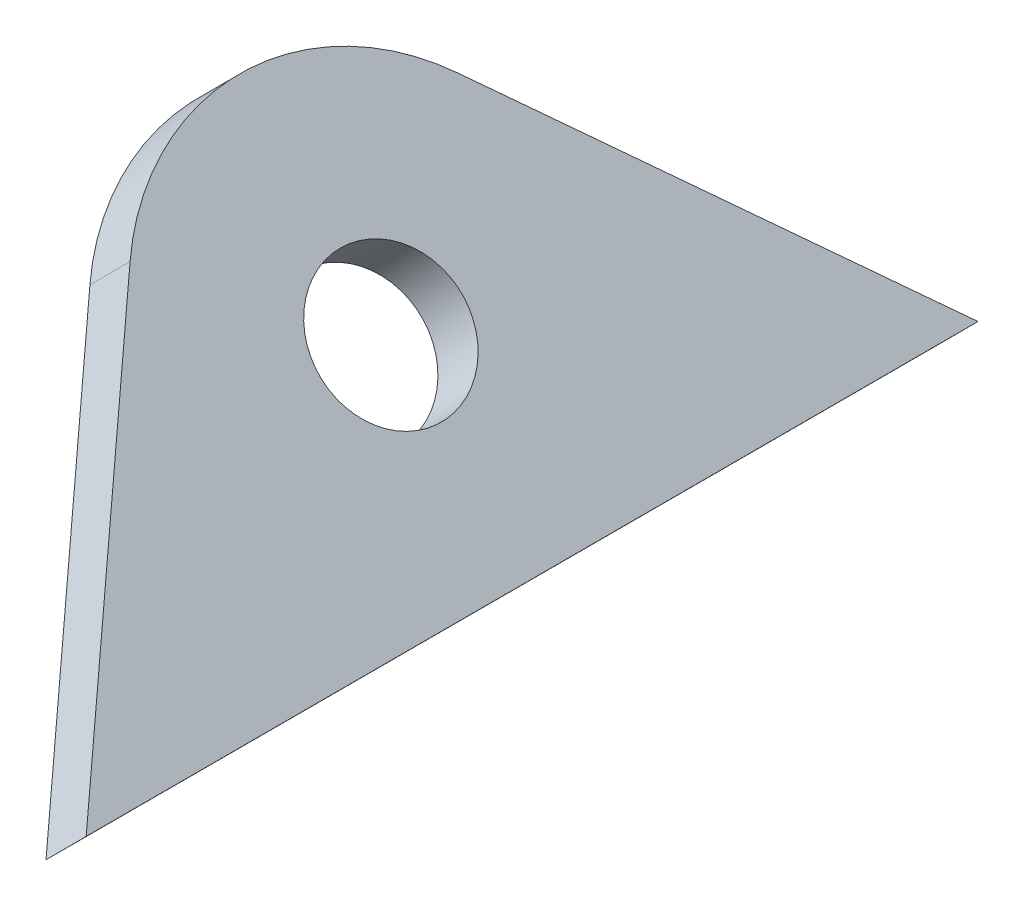
ISO-10303-21;
HEADER;
FILE_DESCRIPTION(('STEP AP214'),'2;1');
FILE_NAME('part.step','',(''),(''),'','','');
FILE_SCHEMA(('AUTOMOTIVE_DESIGN { 1 0 10303 214 1 1 1 1 }'));
ENDSEC;
DATA;
#1=APPLICATION_CONTEXT('core data for automotive mechanical design processes');
#2=APPLICATION_PROTOCOL_DEFINITION('international standard','automotive_design',2000,#1);
#3=PRODUCT_CONTEXT('',#1,'mechanical');
#4=PRODUCT('Part','Part','',(#3));
#5=PRODUCT_RELATED_PRODUCT_CATEGORY('part','',(#4));
#6=PRODUCT_DEFINITION_FORMATION('','',#4);
#7=PRODUCT_DEFINITION_CONTEXT('part definition',#1,'design');
#8=PRODUCT_DEFINITION('design','',#6,#7);
#9=PRODUCT_DEFINITION_SHAPE('','',#8);
#10=(LENGTH_UNIT() NAMED_UNIT(*) SI_UNIT(.MILLI.,.METRE.));
#11=(NAMED_UNIT(*) PLANE_ANGLE_UNIT() SI_UNIT($,.RADIAN.));
#12=(NAMED_UNIT(*) SI_UNIT($,.STERADIAN.) SOLID_ANGLE_UNIT());
#13=UNCERTAINTY_MEASURE_WITH_UNIT(LENGTH_MEASURE(1.E-05),#10,'distance_accuracy_value','');
#14=(GEOMETRIC_REPRESENTATION_CONTEXT(3) GLOBAL_UNCERTAINTY_ASSIGNED_CONTEXT((#13)) GLOBAL_UNIT_ASSIGNED_CONTEXT((#10,
#11,#12)) REPRESENTATION_CONTEXT('',''));
#15=CARTESIAN_POINT('',(0.,0.,0.));
#16=DIRECTION('',(0.,0.,1.));
#17=DIRECTION('',(1.,0.,0.));
#18=AXIS2_PLACEMENT_3D('',#15,#16,#17);
#19=CARTESIAN_POINT('',(-582.241048746185,57.8841264232373,88.9));
#20=DIRECTION('',(0.70560384479698,0.708606529893508,0.));
#21=DIRECTION('',(-0.708606529893508,0.70560384479698,0.));
#22=AXIS2_PLACEMENT_3D('',#19,#20,#21);
#23=CYLINDRICAL_SURFACE('',#22,9.52500000000002);
#24=CARTESIAN_POINT('',(-580.448814980401,59.6839870091668,88.9));
#25=DIRECTION('',(0.70560384479698,0.708606529893508,0.));
#26=DIRECTION('',(0.708606529893508,-0.70560384479698,0.));
#27=AXIS2_PLACEMENT_3D('',#24,#25,#26);
#28=CIRCLE('',#27,9.52500000000002);
#29=CARTESIAN_POINT('',(-584.787295294646,64.0040832278219,81.6034266792917));
#30=VERTEX_POINT('',#29);
#31=CARTESIAN_POINT('',(-584.787295294646,64.0040832278219,96.1965733207083));
#32=VERTEX_POINT('',#31);
#33=EDGE_CURVE('E99',#30,#32,#28,.T.);
#34=ORIENTED_EDGE('',*,*,#33,.F.);
#35=DIRECTION('',(0.70560384479698,0.708606529893508,0.));
#36=VECTOR('',#35,1.);
#37=CARTESIAN_POINT('',(-586.57952906043,62.2042226418924,81.6034266792917));
#38=LINE('',#37,#36);
#39=CARTESIAN_POINT('',(-586.57952906043,62.2042226418924,81.6034266792917));
#40=VERTEX_POINT('',#39);
#41=EDGE_CURVE('E11',#40,#30,#38,.T.);
#42=ORIENTED_EDGE('',*,*,#41,.F.);
#43=CARTESIAN_POINT('',(-582.241048746185,57.8841264232373,88.9));
#44=DIRECTION('',(0.70560384479698,0.708606529893508,0.));
#45=DIRECTION('',(0.708606529893508,-0.70560384479698,0.));
#46=AXIS2_PLACEMENT_3D('',#43,#44,#45);
#47=CIRCLE('',#46,9.52500000000002);
#48=CARTESIAN_POINT('',(-586.57952906043,62.2042226418924,96.1965733207083));
#49=VERTEX_POINT('',#48);
#50=EDGE_CURVE('E92',#40,#49,#47,.T.);
#51=ORIENTED_EDGE('',*,*,#50,.T.);
#52=DIRECTION('',(0.70560384479698,0.708606529893508,0.));
#53=VECTOR('',#52,1.);
#54=CARTESIAN_POINT('',(-586.57952906043,62.2042226418924,96.1965733207083));
#55=LINE('',#54,#53);
#56=EDGE_CURVE('E37',#49,#32,#55,.T.);
#57=ORIENTED_EDGE('',*,*,#56,.T.);
#58=EDGE_LOOP('',(#34,#42,#51,#57));
#59=FACE_BOUND('',#58,.T.);
#60=ADVANCED_FACE('F34',(#59),#23,.T.);
#61=CARTESIAN_POINT('',(-575.941536695432,51.6113082429921,69.0063998479438));
#62=DIRECTION('',(-0.455483497558524,0.453553408782686,-0.766044443118975));
#63=DIRECTION('',(-0.859537064838671,0.,0.511073413678037));
#64=AXIS2_PLACEMENT_3D('',#61,#62,#63);
#65=PLANE('',#64);
#66=DIRECTION('',(-0.542824094582743,0.540523904350109,0.642787609686543));
#67=VECTOR('',#66,1.);
#68=CARTESIAN_POINT('',(-574.149302929648,53.4111688289216,69.0063998479438));
#69=LINE('',#68,#67);
#70=CARTESIAN_POINT('',(-574.149302929648,53.4111688289216,69.0063998479438));
#71=VERTEX_POINT('',#70);
#72=EDGE_CURVE('E94',#71,#30,#69,.T.);
#73=ORIENTED_EDGE('',*,*,#72,.F.);
#74=DIRECTION('',(0.70560384479698,0.708606529893508,0.));
#75=VECTOR('',#74,1.);
#76=CARTESIAN_POINT('',(-575.941536695432,51.6113082429921,69.0063998479438));
#77=LINE('',#76,#75);
#78=CARTESIAN_POINT('',(-575.941536695432,51.6113082429921,69.0063998479438));
#79=VERTEX_POINT('',#78);
#80=EDGE_CURVE('E43',#79,#71,#77,.T.);
#81=ORIENTED_EDGE('',*,*,#80,.F.);
#82=DIRECTION('',(-0.542824094582743,0.540523904350109,0.642787609686543));
#83=VECTOR('',#82,1.);
#84=CARTESIAN_POINT('',(-575.941536695432,51.6113082429921,69.0063998479438));
#85=LINE('',#84,#83);
#86=EDGE_CURVE('E89',#79,#40,#85,.T.);
#87=ORIENTED_EDGE('',*,*,#86,.T.);
#88=ORIENTED_EDGE('',*,*,#41,.T.);
#89=EDGE_LOOP('',(#73,#81,#87,#88));
#90=FACE_BOUND('',#89,.T.);
#91=ADVANCED_FACE('F110',(#90),#65,.T.);
#92=CARTESIAN_POINT('',(-575.941536695432,51.6113082429921,108.793600152056));
#93=DIRECTION('',(0.708606529893508,-0.70560384479698,0.));
#94=DIRECTION('',(0.70560384479698,0.708606529893508,0.));
#95=AXIS2_PLACEMENT_3D('',#92,#93,#94);
#96=PLANE('',#95);
#97=DIRECTION('',(0.,0.,-1.));
#98=VECTOR('',#97,1.);
#99=CARTESIAN_POINT('',(-574.149302929648,53.4111688289216,108.793600152056));
#100=LINE('',#99,#98);
#101=CARTESIAN_POINT('',(-574.149302929648,53.4111688289216,108.793600152056));
#102=VERTEX_POINT('',#101);
#103=EDGE_CURVE('E84',#102,#71,#100,.T.);
#104=ORIENTED_EDGE('',*,*,#103,.F.);
#105=DIRECTION('',(0.70560384479698,0.708606529893508,0.));
#106=VECTOR('',#105,1.);
#107=CARTESIAN_POINT('',(-575.941536695432,51.6113082429921,108.793600152056));
#108=LINE('',#107,#106);
#109=CARTESIAN_POINT('',(-575.941536695432,51.6113082429921,108.793600152056));
#110=VERTEX_POINT('',#109);
#111=EDGE_CURVE('E79',#110,#102,#108,.T.);
#112=ORIENTED_EDGE('',*,*,#111,.F.);
#113=DIRECTION('',(0.,0.,-1.));
#114=VECTOR('',#113,1.);
#115=CARTESIAN_POINT('',(-575.941536695432,51.6113082429921,108.793600152056));
#116=LINE('',#115,#114);
#117=EDGE_CURVE('E82',#110,#79,#116,.T.);
#118=ORIENTED_EDGE('',*,*,#117,.T.);
#119=ORIENTED_EDGE('',*,*,#80,.T.);
#120=EDGE_LOOP('',(#104,#112,#118,#119));
#121=FACE_BOUND('',#120,.T.);
#122=ADVANCED_FACE('F81',(#121),#96,.T.);
#123=CARTESIAN_POINT('',(-586.57952906043,62.2042226418924,96.1965733207083));
#124=DIRECTION('',(-0.455483497558524,0.453553408782686,0.766044443118974));
#125=DIRECTION('',(0.859537064838671,0.,0.511073413678038));
#126=AXIS2_PLACEMENT_3D('',#123,#124,#125);
#127=PLANE('',#126);
#128=DIRECTION('',(0.542824094582742,-0.540523904350109,0.642787609686544));
#129=VECTOR('',#128,1.);
#130=CARTESIAN_POINT('',(-584.787295294646,64.0040832278219,96.1965733207083));
#131=LINE('',#130,#129);
#132=EDGE_CURVE('E102',#32,#102,#131,.T.);
#133=ORIENTED_EDGE('',*,*,#132,.F.);
#134=ORIENTED_EDGE('',*,*,#56,.F.);
#135=DIRECTION('',(0.542824094582742,-0.540523904350109,0.642787609686544));
#136=VECTOR('',#135,1.);
#137=CARTESIAN_POINT('',(-586.57952906043,62.2042226418924,96.1965733207083));
#138=LINE('',#137,#136);
#139=EDGE_CURVE('E88',#49,#110,#138,.T.);
#140=ORIENTED_EDGE('',*,*,#139,.T.);
#141=ORIENTED_EDGE('',*,*,#111,.T.);
#142=EDGE_LOOP('',(#133,#134,#140,#141));
#143=FACE_BOUND('',#142,.T.);
#144=ADVANCED_FACE('F91',(#143),#127,.T.);
#145=CARTESIAN_POINT('',(-582.241048746185,57.8841264232373,88.9));
#146=DIRECTION('',(-0.70560384479698,-0.708606529893508,0.));
#147=DIRECTION('',(0.708606529893508,-0.70560384479698,0.));
#148=AXIS2_PLACEMENT_3D('',#145,#146,#147);
#149=PLANE('',#148);
#150=CARTESIAN_POINT('',(-582.241048746185,57.8841264232373,88.9));
#151=DIRECTION('',(0.70560384479698,0.708606529893508,0.));
#152=DIRECTION('',(-0.708606529893508,0.70560384479698,0.));
#153=AXIS2_PLACEMENT_3D('',#150,#151,#152);
#154=CIRCLE('',#153,3.17499999999999);
#155=CARTESIAN_POINT('',(-584.490874478597,60.1244186304677,88.9));
#156=VERTEX_POINT('',#155);
#157=EDGE_CURVE('E103',#156,#156,#154,.T.);
#158=ORIENTED_EDGE('',*,*,#157,.T.);
#159=EDGE_LOOP('',(#158));
#160=FACE_BOUND('',#159,.T.);
#161=ORIENTED_EDGE('',*,*,#50,.F.);
#162=ORIENTED_EDGE('',*,*,#86,.F.);
#163=ORIENTED_EDGE('',*,*,#117,.F.);
#164=ORIENTED_EDGE('',*,*,#139,.F.);
#165=EDGE_LOOP('',(#161,#162,#163,#164));
#166=FACE_BOUND('',#165,.T.);
#167=ADVANCED_FACE('F87',(#160,#166),#149,.T.);
#168=CARTESIAN_POINT('',(-580.448814980401,59.6839870091668,88.9));
#169=DIRECTION('',(-0.70560384479698,-0.708606529893508,0.));
#170=DIRECTION('',(0.708606529893508,-0.70560384479698,0.));
#171=AXIS2_PLACEMENT_3D('',#168,#169,#170);
#172=PLANE('',#171);
#173=CARTESIAN_POINT('',(-580.448814980401,59.6839870091668,88.9));
#174=DIRECTION('',(0.70560384479698,0.708606529893508,0.));
#175=DIRECTION('',(-0.708606529893508,0.70560384479698,0.));
#176=AXIS2_PLACEMENT_3D('',#173,#174,#175);
#177=CIRCLE('',#176,3.17499999999999);
#178=CARTESIAN_POINT('',(-582.698640712813,61.9242792163972,88.9));
#179=VERTEX_POINT('',#178);
#180=EDGE_CURVE('E140',#179,#179,#177,.T.);
#181=ORIENTED_EDGE('',*,*,#180,.F.);
#182=EDGE_LOOP('',(#181));
#183=FACE_BOUND('',#182,.T.);
#184=ORIENTED_EDGE('',*,*,#33,.T.);
#185=ORIENTED_EDGE('',*,*,#132,.T.);
#186=ORIENTED_EDGE('',*,*,#103,.T.);
#187=ORIENTED_EDGE('',*,*,#72,.T.);
#188=EDGE_LOOP('',(#184,#185,#186,#187));
#189=FACE_BOUND('',#188,.T.);
#190=ADVANCED_FACE('F109',(#183,#189),#172,.F.);
#191=CARTESIAN_POINT('',(-582.241048746185,57.8841264232373,88.9));
#192=DIRECTION('',(0.70560384479698,0.708606529893508,0.));
#193=DIRECTION('',(-0.708606529893508,0.70560384479698,0.));
#194=AXIS2_PLACEMENT_3D('',#191,#192,#193);
#195=CYLINDRICAL_SURFACE('',#194,3.17499999999999);
#196=ORIENTED_EDGE('',*,*,#157,.F.);
#197=EDGE_LOOP('',(#196));
#198=FACE_BOUND('',#197,.T.);
#199=ORIENTED_EDGE('',*,*,#180,.T.);
#200=EDGE_LOOP('',(#199));
#201=FACE_BOUND('',#200,.T.);
#202=ADVANCED_FACE('F128',(#198,#201),#195,.F.);
#203=CLOSED_SHELL('',(#60,#91,#122,#144,#167,#190,#202));
#204=MANIFOLD_SOLID_BREP('B2',#203);
#205=ADVANCED_BREP_SHAPE_REPRESENTATION('',(#18,#204),#14);
#206=SHAPE_DEFINITION_REPRESENTATION(#9,#205);
ENDSEC;
END-ISO-10303-21;
